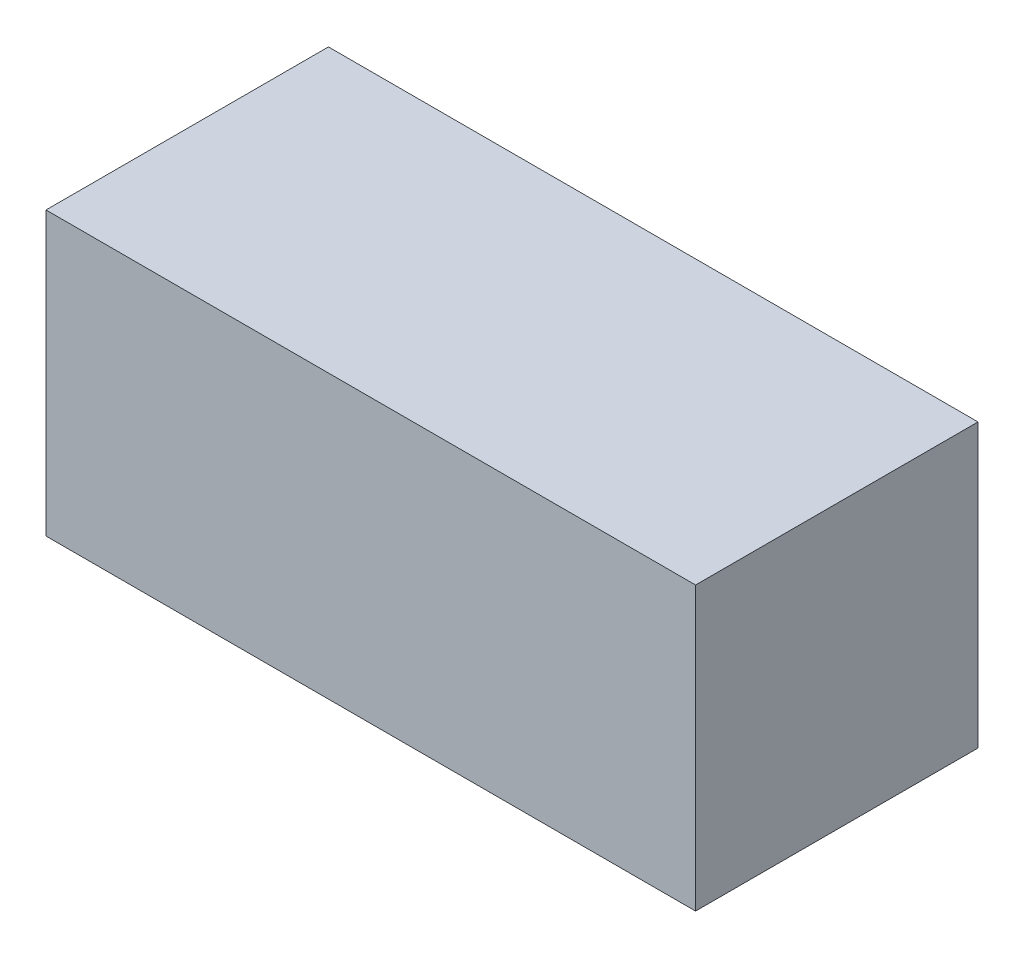
ISO-10303-21;
HEADER;
FILE_DESCRIPTION(('STEP AP214'),'2;1');
FILE_NAME('part.step','',(''),(''),'','','');
FILE_SCHEMA(('AUTOMOTIVE_DESIGN { 1 0 10303 214 1 1 1 1 }'));
ENDSEC;
DATA;
#1=APPLICATION_CONTEXT('core data for automotive mechanical design processes');
#2=APPLICATION_PROTOCOL_DEFINITION('international standard','automotive_design',2000,#1);
#3=PRODUCT_CONTEXT('',#1,'mechanical');
#4=PRODUCT('Part','Part','',(#3));
#5=PRODUCT_RELATED_PRODUCT_CATEGORY('part','',(#4));
#6=PRODUCT_DEFINITION_FORMATION('','',#4);
#7=PRODUCT_DEFINITION_CONTEXT('part definition',#1,'design');
#8=PRODUCT_DEFINITION('design','',#6,#7);
#9=PRODUCT_DEFINITION_SHAPE('','',#8);
#10=(LENGTH_UNIT() NAMED_UNIT(*) SI_UNIT(.MILLI.,.METRE.));
#11=(NAMED_UNIT(*) PLANE_ANGLE_UNIT() SI_UNIT($,.RADIAN.));
#12=(NAMED_UNIT(*) SI_UNIT($,.STERADIAN.) SOLID_ANGLE_UNIT());
#13=UNCERTAINTY_MEASURE_WITH_UNIT(LENGTH_MEASURE(1.E-05),#10,'distance_accuracy_value','');
#14=(GEOMETRIC_REPRESENTATION_CONTEXT(3) GLOBAL_UNCERTAINTY_ASSIGNED_CONTEXT((#13)) GLOBAL_UNIT_ASSIGNED_CONTEXT((#10,
#11,#12)) REPRESENTATION_CONTEXT('',''));
#15=CARTESIAN_POINT('',(0.,0.,0.));
#16=DIRECTION('',(0.,0.,1.));
#17=DIRECTION('',(1.,0.,0.));
#18=AXIS2_PLACEMENT_3D('',#15,#16,#17);
#19=CARTESIAN_POINT('',(5.75,26.3,5.));
#20=DIRECTION('',(-1.,0.,0.));
#21=DIRECTION('',(0.,-1.,0.));
#22=AXIS2_PLACEMENT_3D('',#19,#20,#21);
#23=PLANE('',#22);
#24=DIRECTION('',(0.,1.,0.));
#25=VECTOR('',#24,1.);
#26=CARTESIAN_POINT('',(5.75,26.3,0.));
#27=LINE('',#26,#25);
#28=CARTESIAN_POINT('',(5.75,21.3,0.));
#29=VERTEX_POINT('',#28);
#30=CARTESIAN_POINT('',(5.75,26.3,0.));
#31=VERTEX_POINT('',#30);
#32=EDGE_CURVE('E96',#29,#31,#27,.T.);
#33=ORIENTED_EDGE('',*,*,#32,.T.);
#34=DIRECTION('',(0.,0.,-1.));
#35=VECTOR('',#34,1.);
#36=CARTESIAN_POINT('',(5.75,26.3,5.));
#37=LINE('',#36,#35);
#38=CARTESIAN_POINT('',(5.75,26.3,5.));
#39=VERTEX_POINT('',#38);
#40=EDGE_CURVE('E11',#39,#31,#37,.T.);
#41=ORIENTED_EDGE('',*,*,#40,.F.);
#42=DIRECTION('',(0.,1.,0.));
#43=VECTOR('',#42,1.);
#44=CARTESIAN_POINT('',(5.75,26.3,5.));
#45=LINE('',#44,#43);
#46=CARTESIAN_POINT('',(5.75,21.3,5.));
#47=VERTEX_POINT('',#46);
#48=EDGE_CURVE('E84',#47,#39,#45,.T.);
#49=ORIENTED_EDGE('',*,*,#48,.F.);
#50=DIRECTION('',(0.,0.,-1.));
#51=VECTOR('',#50,1.);
#52=CARTESIAN_POINT('',(5.75,21.3,5.));
#53=LINE('',#52,#51);
#54=EDGE_CURVE('E92',#47,#29,#53,.T.);
#55=ORIENTED_EDGE('',*,*,#54,.T.);
#56=EDGE_LOOP('',(#33,#41,#49,#55));
#57=FACE_BOUND('',#56,.T.);
#58=ADVANCED_FACE('F33',(#57),#23,.F.);
#59=CARTESIAN_POINT('',(-5.75,26.3,5.));
#60=DIRECTION('',(0.,-1.,0.));
#61=DIRECTION('',(0.,0.,-1.));
#62=AXIS2_PLACEMENT_3D('',#59,#60,#61);
#63=PLANE('',#62);
#64=DIRECTION('',(-1.,0.,0.));
#65=VECTOR('',#64,1.);
#66=CARTESIAN_POINT('',(-5.75,26.3,0.));
#67=LINE('',#66,#65);
#68=CARTESIAN_POINT('',(-5.75,26.3,0.));
#69=VERTEX_POINT('',#68);
#70=EDGE_CURVE('E88',#31,#69,#67,.T.);
#71=ORIENTED_EDGE('',*,*,#70,.T.);
#72=DIRECTION('',(0.,0.,-1.));
#73=VECTOR('',#72,1.);
#74=CARTESIAN_POINT('',(-5.75,26.3,5.));
#75=LINE('',#74,#73);
#76=CARTESIAN_POINT('',(-5.75,26.3,5.));
#77=VERTEX_POINT('',#76);
#78=EDGE_CURVE('E41',#77,#69,#75,.T.);
#79=ORIENTED_EDGE('',*,*,#78,.F.);
#80=DIRECTION('',(-1.,0.,0.));
#81=VECTOR('',#80,1.);
#82=CARTESIAN_POINT('',(-5.75,26.3,5.));
#83=LINE('',#82,#81);
#84=EDGE_CURVE('E79',#39,#77,#83,.T.);
#85=ORIENTED_EDGE('',*,*,#84,.F.);
#86=ORIENTED_EDGE('',*,*,#40,.T.);
#87=EDGE_LOOP('',(#71,#79,#85,#86));
#88=FACE_BOUND('',#87,.T.);
#89=ADVANCED_FACE('F87',(#88),#63,.F.);
#90=CARTESIAN_POINT('',(-5.75,26.3,5.));
#91=DIRECTION('',(1.,0.,0.));
#92=DIRECTION('',(0.,1.,0.));
#93=AXIS2_PLACEMENT_3D('',#90,#91,#92);
#94=PLANE('',#93);
#95=DIRECTION('',(0.,-1.,0.));
#96=VECTOR('',#95,1.);
#97=CARTESIAN_POINT('',(-5.75,26.3,0.));
#98=LINE('',#97,#96);
#99=CARTESIAN_POINT('',(-5.75,21.3,0.));
#100=VERTEX_POINT('',#99);
#101=EDGE_CURVE('E66',#69,#100,#98,.T.);
#102=ORIENTED_EDGE('',*,*,#101,.T.);
#103=DIRECTION('',(0.,0.,-1.));
#104=VECTOR('',#103,1.);
#105=CARTESIAN_POINT('',(-5.75,21.3,5.));
#106=LINE('',#105,#104);
#107=CARTESIAN_POINT('',(-5.75,21.3,5.));
#108=VERTEX_POINT('',#107);
#109=EDGE_CURVE('E89',#108,#100,#106,.T.);
#110=ORIENTED_EDGE('',*,*,#109,.F.);
#111=DIRECTION('',(0.,-1.,0.));
#112=VECTOR('',#111,1.);
#113=CARTESIAN_POINT('',(-5.75,26.3,5.));
#114=LINE('',#113,#112);
#115=EDGE_CURVE('E82',#77,#108,#114,.T.);
#116=ORIENTED_EDGE('',*,*,#115,.F.);
#117=ORIENTED_EDGE('',*,*,#78,.T.);
#118=EDGE_LOOP('',(#102,#110,#116,#117));
#119=FACE_BOUND('',#118,.T.);
#120=ADVANCED_FACE('F90',(#119),#94,.F.);
#121=CARTESIAN_POINT('',(-5.75,21.3,5.));
#122=DIRECTION('',(0.,1.,0.));
#123=DIRECTION('',(0.,0.,1.));
#124=AXIS2_PLACEMENT_3D('',#121,#122,#123);
#125=PLANE('',#124);
#126=DIRECTION('',(1.,0.,0.));
#127=VECTOR('',#126,1.);
#128=CARTESIAN_POINT('',(-5.75,21.3,0.));
#129=LINE('',#128,#127);
#130=EDGE_CURVE('E72',#100,#29,#129,.T.);
#131=ORIENTED_EDGE('',*,*,#130,.T.);
#132=ORIENTED_EDGE('',*,*,#54,.F.);
#133=DIRECTION('',(1.,0.,0.));
#134=VECTOR('',#133,1.);
#135=CARTESIAN_POINT('',(-5.75,21.3,5.));
#136=LINE('',#135,#134);
#137=EDGE_CURVE('E49',#108,#47,#136,.T.);
#138=ORIENTED_EDGE('',*,*,#137,.F.);
#139=ORIENTED_EDGE('',*,*,#109,.T.);
#140=EDGE_LOOP('',(#131,#132,#138,#139));
#141=FACE_BOUND('',#140,.T.);
#142=ADVANCED_FACE('F103',(#141),#125,.F.);
#143=CARTESIAN_POINT('',(0.,0.,5.));
#144=DIRECTION('',(0.,0.,1.));
#145=DIRECTION('',(1.,0.,0.));
#146=AXIS2_PLACEMENT_3D('',#143,#144,#145);
#147=PLANE('',#146);
#148=ORIENTED_EDGE('',*,*,#48,.T.);
#149=ORIENTED_EDGE('',*,*,#84,.T.);
#150=ORIENTED_EDGE('',*,*,#115,.T.);
#151=ORIENTED_EDGE('',*,*,#137,.T.);
#152=EDGE_LOOP('',(#148,#149,#150,#151));
#153=FACE_BOUND('',#152,.T.);
#154=ADVANCED_FACE('F80',(#153),#147,.T.);
#155=CARTESIAN_POINT('',(0.,0.,0.));
#156=DIRECTION('',(0.,0.,1.));
#157=DIRECTION('',(1.,0.,0.));
#158=AXIS2_PLACEMENT_3D('',#155,#156,#157);
#159=PLANE('',#158);
#160=ORIENTED_EDGE('',*,*,#32,.F.);
#161=ORIENTED_EDGE('',*,*,#130,.F.);
#162=ORIENTED_EDGE('',*,*,#101,.F.);
#163=ORIENTED_EDGE('',*,*,#70,.F.);
#164=EDGE_LOOP('',(#160,#161,#162,#163));
#165=FACE_BOUND('',#164,.T.);
#166=ADVANCED_FACE('F106',(#165),#159,.F.);
#167=CLOSED_SHELL('',(#58,#89,#120,#142,#154,#166));
#168=MANIFOLD_SOLID_BREP('B2',#167);
#169=ADVANCED_BREP_SHAPE_REPRESENTATION('',(#18,#168),#14);
#170=SHAPE_DEFINITION_REPRESENTATION(#9,#169);
ENDSEC;
END-ISO-10303-21;
